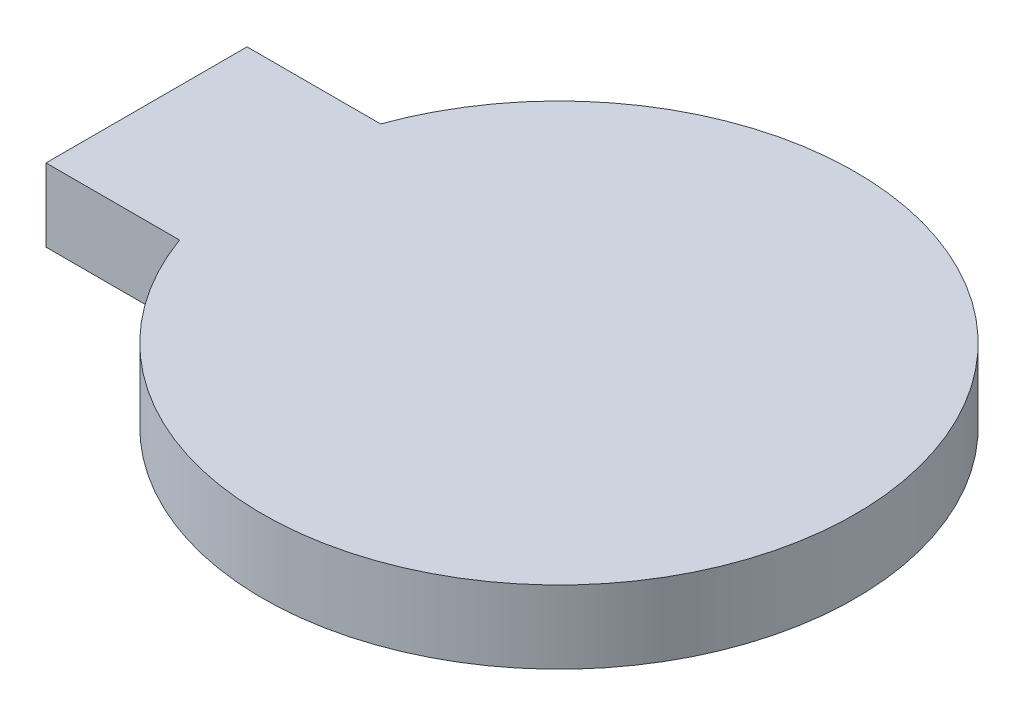
ISO-10303-21;
HEADER;
FILE_DESCRIPTION(('STEP AP214'),'2;1');
FILE_NAME('part.step','',(''),(''),'','','');
FILE_SCHEMA(('AUTOMOTIVE_DESIGN { 1 0 10303 214 1 1 1 1 }'));
ENDSEC;
DATA;
#1=APPLICATION_CONTEXT('core data for automotive mechanical design processes');
#2=APPLICATION_PROTOCOL_DEFINITION('international standard','automotive_design',2000,#1);
#3=PRODUCT_CONTEXT('',#1,'mechanical');
#4=PRODUCT('Part','Part','',(#3));
#5=PRODUCT_RELATED_PRODUCT_CATEGORY('part','',(#4));
#6=PRODUCT_DEFINITION_FORMATION('','',#4);
#7=PRODUCT_DEFINITION_CONTEXT('part definition',#1,'design');
#8=PRODUCT_DEFINITION('design','',#6,#7);
#9=PRODUCT_DEFINITION_SHAPE('','',#8);
#10=(LENGTH_UNIT() NAMED_UNIT(*) SI_UNIT(.MILLI.,.METRE.));
#11=(NAMED_UNIT(*) PLANE_ANGLE_UNIT() SI_UNIT($,.RADIAN.));
#12=(NAMED_UNIT(*) SI_UNIT($,.STERADIAN.) SOLID_ANGLE_UNIT());
#13=UNCERTAINTY_MEASURE_WITH_UNIT(LENGTH_MEASURE(1.E-05),#10,'distance_accuracy_value','');
#14=(GEOMETRIC_REPRESENTATION_CONTEXT(3) GLOBAL_UNCERTAINTY_ASSIGNED_CONTEXT((#13)) GLOBAL_UNIT_ASSIGNED_CONTEXT((#10,
#11,#12)) REPRESENTATION_CONTEXT('',''));
#15=CARTESIAN_POINT('',(0.,0.,0.));
#16=DIRECTION('',(0.,0.,1.));
#17=DIRECTION('',(1.,0.,0.));
#18=AXIS2_PLACEMENT_3D('',#15,#16,#17);
#19=CARTESIAN_POINT('',(-16.,2.83,-3.9));
#20=DIRECTION('',(1.,0.,0.));
#21=DIRECTION('',(0.,0.,-1.));
#22=AXIS2_PLACEMENT_3D('',#19,#20,#21);
#23=PLANE('',#22);
#24=DIRECTION('',(0.,0.,1.));
#25=VECTOR('',#24,1.);
#26=CARTESIAN_POINT('',(-16.,0.,-3.9));
#27=LINE('',#26,#25);
#28=CARTESIAN_POINT('',(-16.,0.,-3.9));
#29=VERTEX_POINT('',#28);
#30=CARTESIAN_POINT('',(-16.,0.,3.9));
#31=VERTEX_POINT('',#30);
#32=EDGE_CURVE('E102',#29,#31,#27,.T.);
#33=ORIENTED_EDGE('',*,*,#32,.T.);
#34=DIRECTION('',(0.,-1.,0.));
#35=VECTOR('',#34,1.);
#36=CARTESIAN_POINT('',(-16.,2.83,3.9));
#37=LINE('',#36,#35);
#38=CARTESIAN_POINT('',(-16.,2.83,3.9));
#39=VERTEX_POINT('',#38);
#40=EDGE_CURVE('E39',#39,#31,#37,.T.);
#41=ORIENTED_EDGE('',*,*,#40,.F.);
#42=DIRECTION('',(0.,0.,1.));
#43=VECTOR('',#42,1.);
#44=CARTESIAN_POINT('',(-16.,2.83,-3.9));
#45=LINE('',#44,#43);
#46=CARTESIAN_POINT('',(-16.,2.83,-3.9));
#47=VERTEX_POINT('',#46);
#48=EDGE_CURVE('E89',#47,#39,#45,.T.);
#49=ORIENTED_EDGE('',*,*,#48,.F.);
#50=DIRECTION('',(0.,-1.,0.));
#51=VECTOR('',#50,1.);
#52=CARTESIAN_POINT('',(-16.,2.83,-3.9));
#53=LINE('',#52,#51);
#54=EDGE_CURVE('E98',#47,#29,#53,.T.);
#55=ORIENTED_EDGE('',*,*,#54,.T.);
#56=EDGE_LOOP('',(#33,#41,#49,#55));
#57=FACE_BOUND('',#56,.T.);
#58=ADVANCED_FACE('F36',(#57),#23,.F.);
#59=CARTESIAN_POINT('',(-16.,2.83,3.9));
#60=DIRECTION('',(0.,0.,-1.));
#61=DIRECTION('',(-1.,0.,0.));
#62=AXIS2_PLACEMENT_3D('',#59,#60,#61);
#63=PLANE('',#62);
#64=DIRECTION('',(1.,0.,0.));
#65=VECTOR('',#64,1.);
#66=CARTESIAN_POINT('',(-16.,0.,3.9));
#67=LINE('',#66,#65);
#68=CARTESIAN_POINT('',(-10.8185026690388,0.,3.89999999999999));
#69=VERTEX_POINT('',#68);
#70=EDGE_CURVE('E94',#31,#69,#67,.T.);
#71=ORIENTED_EDGE('',*,*,#70,.T.);
#72=DIRECTION('',(0.,-1.,0.));
#73=VECTOR('',#72,1.);
#74=CARTESIAN_POINT('',(-10.8185026690388,2.83,3.89999999999999));
#75=LINE('',#74,#73);
#76=CARTESIAN_POINT('',(-10.8185026690388,2.83,3.89999999999999));
#77=VERTEX_POINT('',#76);
#78=EDGE_CURVE('E92',#77,#69,#75,.T.);
#79=ORIENTED_EDGE('',*,*,#78,.F.);
#80=DIRECTION('',(1.,0.,0.));
#81=VECTOR('',#80,1.);
#82=CARTESIAN_POINT('',(-16.,2.83,3.9));
#83=LINE('',#82,#81);
#84=EDGE_CURVE('E84',#39,#77,#83,.T.);
#85=ORIENTED_EDGE('',*,*,#84,.F.);
#86=ORIENTED_EDGE('',*,*,#40,.T.);
#87=EDGE_LOOP('',(#71,#79,#85,#86));
#88=FACE_BOUND('',#87,.T.);
#89=ADVANCED_FACE('F93',(#88),#63,.F.);
#90=CARTESIAN_POINT('',(0.,2.83,0.));
#91=DIRECTION('',(0.,-1.,0.));
#92=DIRECTION('',(0.,0.,-1.));
#93=AXIS2_PLACEMENT_3D('',#90,#91,#92);
#94=CYLINDRICAL_SURFACE('',#93,11.5);
#95=CARTESIAN_POINT('',(0.,0.,0.));
#96=DIRECTION('',(0.,1.,0.));
#97=DIRECTION('',(0.,0.,1.));
#98=AXIS2_PLACEMENT_3D('',#95,#96,#97);
#99=CIRCLE('',#98,11.5);
#100=CARTESIAN_POINT('',(-10.8185026690388,0.,-3.9));
#101=VERTEX_POINT('',#100);
#102=EDGE_CURVE('E70',#69,#101,#99,.T.);
#103=ORIENTED_EDGE('',*,*,#102,.T.);
#104=DIRECTION('',(0.,-1.,0.));
#105=VECTOR('',#104,1.);
#106=CARTESIAN_POINT('',(-10.8185026690388,2.83,-3.9));
#107=LINE('',#106,#105);
#108=CARTESIAN_POINT('',(-10.8185026690388,2.83,-3.9));
#109=VERTEX_POINT('',#108);
#110=EDGE_CURVE('E95',#109,#101,#107,.T.);
#111=ORIENTED_EDGE('',*,*,#110,.F.);
#112=CARTESIAN_POINT('',(0.,2.83,0.));
#113=DIRECTION('',(0.,1.,0.));
#114=DIRECTION('',(0.,0.,1.));
#115=AXIS2_PLACEMENT_3D('',#112,#113,#114);
#116=CIRCLE('',#115,11.5);
#117=EDGE_CURVE('E87',#77,#109,#116,.T.);
#118=ORIENTED_EDGE('',*,*,#117,.F.);
#119=ORIENTED_EDGE('',*,*,#78,.T.);
#120=EDGE_LOOP('',(#103,#111,#118,#119));
#121=FACE_BOUND('',#120,.T.);
#122=ADVANCED_FACE('F96',(#121),#94,.T.);
#123=CARTESIAN_POINT('',(-16.,2.83,-3.9));
#124=DIRECTION('',(0.,0.,1.));
#125=DIRECTION('',(1.,0.,0.));
#126=AXIS2_PLACEMENT_3D('',#123,#124,#125);
#127=PLANE('',#126);
#128=DIRECTION('',(-1.,0.,0.));
#129=VECTOR('',#128,1.);
#130=CARTESIAN_POINT('',(-16.,0.,-3.9));
#131=LINE('',#130,#129);
#132=EDGE_CURVE('E76',#101,#29,#131,.T.);
#133=ORIENTED_EDGE('',*,*,#132,.T.);
#134=ORIENTED_EDGE('',*,*,#54,.F.);
#135=DIRECTION('',(-1.,0.,0.));
#136=VECTOR('',#135,1.);
#137=CARTESIAN_POINT('',(-16.,2.83,-3.9));
#138=LINE('',#137,#136);
#139=EDGE_CURVE('E53',#109,#47,#138,.T.);
#140=ORIENTED_EDGE('',*,*,#139,.F.);
#141=ORIENTED_EDGE('',*,*,#110,.T.);
#142=EDGE_LOOP('',(#133,#134,#140,#141));
#143=FACE_BOUND('',#142,.T.);
#144=ADVANCED_FACE('F110',(#143),#127,.F.);
#145=CARTESIAN_POINT('',(0.,2.83,0.));
#146=DIRECTION('',(0.,1.,0.));
#147=DIRECTION('',(0.,0.,1.));
#148=AXIS2_PLACEMENT_3D('',#145,#146,#147);
#149=PLANE('',#148);
#150=ORIENTED_EDGE('',*,*,#48,.T.);
#151=ORIENTED_EDGE('',*,*,#84,.T.);
#152=ORIENTED_EDGE('',*,*,#117,.T.);
#153=ORIENTED_EDGE('',*,*,#139,.T.);
#154=EDGE_LOOP('',(#150,#151,#152,#153));
#155=FACE_BOUND('',#154,.T.);
#156=ADVANCED_FACE('F85',(#155),#149,.T.);
#157=CARTESIAN_POINT('',(0.,0.,0.));
#158=DIRECTION('',(0.,1.,0.));
#159=DIRECTION('',(0.,0.,1.));
#160=AXIS2_PLACEMENT_3D('',#157,#158,#159);
#161=PLANE('',#160);
#162=CARTESIAN_POINT('',(0.,0.,0.));
#163=DIRECTION('',(0.,-1.,0.));
#164=DIRECTION('',(0.,0.,-1.));
#165=AXIS2_PLACEMENT_3D('',#162,#163,#164);
#166=CIRCLE('',#165,7.92);
#167=CARTESIAN_POINT('',(0.,0.,-7.92));
#168=VERTEX_POINT('',#167);
#169=EDGE_CURVE('E11',#168,#168,#166,.T.);
#170=ORIENTED_EDGE('',*,*,#169,.F.);
#171=EDGE_LOOP('',(#170));
#172=FACE_BOUND('',#171,.T.);
#173=ORIENTED_EDGE('',*,*,#32,.F.);
#174=ORIENTED_EDGE('',*,*,#132,.F.);
#175=ORIENTED_EDGE('',*,*,#102,.F.);
#176=ORIENTED_EDGE('',*,*,#70,.F.);
#177=EDGE_LOOP('',(#173,#174,#175,#176));
#178=FACE_BOUND('',#177,.T.);
#179=ADVANCED_FACE('F113',(#172,#178),#161,.F.);
#180=CARTESIAN_POINT('',(0.,-1.5,0.));
#181=DIRECTION('',(0.,1.,0.));
#182=DIRECTION('',(0.,0.,1.));
#183=AXIS2_PLACEMENT_3D('',#180,#181,#182);
#184=CYLINDRICAL_SURFACE('',#183,7.92);
#185=CARTESIAN_POINT('',(0.,-1.5,0.));
#186=DIRECTION('',(0.,-1.,0.));
#187=DIRECTION('',(0.,0.,-1.));
#188=AXIS2_PLACEMENT_3D('',#185,#186,#187);
#189=CIRCLE('',#188,7.92);
#190=CARTESIAN_POINT('',(0.,-1.5,-7.92));
#191=VERTEX_POINT('',#190);
#192=EDGE_CURVE('E105',#191,#191,#189,.T.);
#193=ORIENTED_EDGE('',*,*,#192,.F.);
#194=EDGE_LOOP('',(#193));
#195=FACE_BOUND('',#194,.T.);
#196=ORIENTED_EDGE('',*,*,#169,.T.);
#197=EDGE_LOOP('',(#196));
#198=FACE_BOUND('',#197,.T.);
#199=ADVANCED_FACE('F121',(#195,#198),#184,.T.);
#200=CARTESIAN_POINT('',(0.,-1.5,0.));
#201=DIRECTION('',(0.,-1.,0.));
#202=DIRECTION('',(0.,0.,-1.));
#203=AXIS2_PLACEMENT_3D('',#200,#201,#202);
#204=PLANE('',#203);
#205=ORIENTED_EDGE('',*,*,#192,.T.);
#206=EDGE_LOOP('',(#205));
#207=FACE_BOUND('',#206,.T.);
#208=ADVANCED_FACE('F119',(#207),#204,.T.);
#209=CLOSED_SHELL('',(#58,#89,#122,#144,#156,#179,#199,#208));
#210=MANIFOLD_SOLID_BREP('B2',#209);
#211=ADVANCED_BREP_SHAPE_REPRESENTATION('',(#18,#210),#14);
#212=SHAPE_DEFINITION_REPRESENTATION(#9,#211);
ENDSEC;
END-ISO-10303-21;
